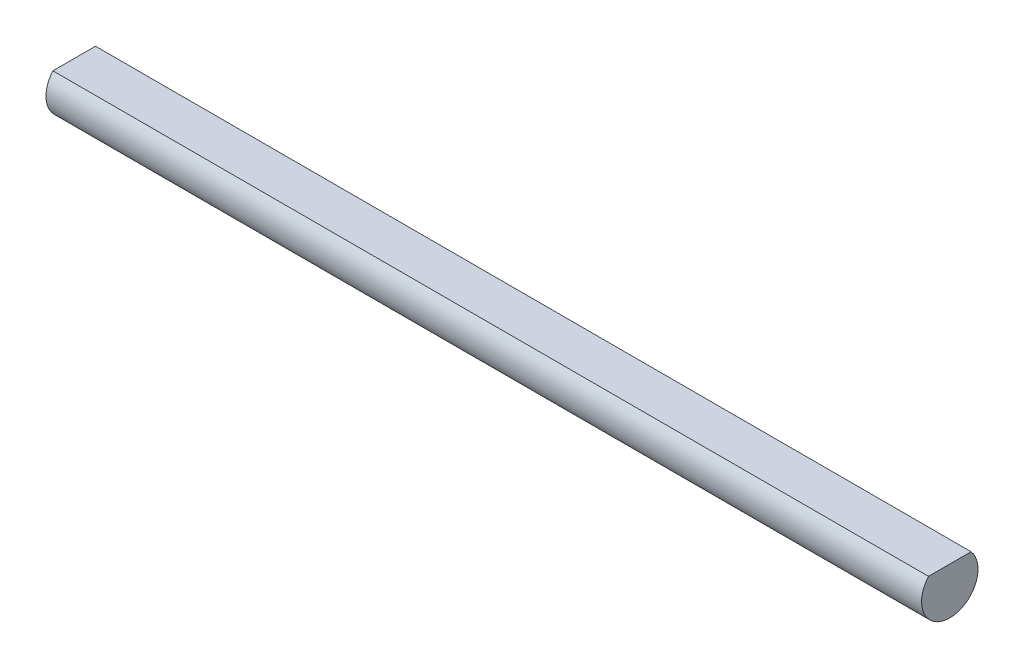
ISO-10303-21;
HEADER;
FILE_DESCRIPTION(('STEP AP214'),'2;1');
FILE_NAME('part.step','',(''),(''),'','','');
FILE_SCHEMA(('AUTOMOTIVE_DESIGN { 1 0 10303 214 1 1 1 1 }'));
ENDSEC;
DATA;
#1=APPLICATION_CONTEXT('core data for automotive mechanical design processes');
#2=APPLICATION_PROTOCOL_DEFINITION('international standard','automotive_design',2000,#1);
#3=PRODUCT_CONTEXT('',#1,'mechanical');
#4=PRODUCT('Part','Part','',(#3));
#5=PRODUCT_RELATED_PRODUCT_CATEGORY('part','',(#4));
#6=PRODUCT_DEFINITION_FORMATION('','',#4);
#7=PRODUCT_DEFINITION_CONTEXT('part definition',#1,'design');
#8=PRODUCT_DEFINITION('design','',#6,#7);
#9=PRODUCT_DEFINITION_SHAPE('','',#8);
#10=(LENGTH_UNIT() NAMED_UNIT(*) SI_UNIT(.MILLI.,.METRE.));
#11=(NAMED_UNIT(*) PLANE_ANGLE_UNIT() SI_UNIT($,.RADIAN.));
#12=(NAMED_UNIT(*) SI_UNIT($,.STERADIAN.) SOLID_ANGLE_UNIT());
#13=UNCERTAINTY_MEASURE_WITH_UNIT(LENGTH_MEASURE(1.E-05),#10,'distance_accuracy_value','');
#14=(GEOMETRIC_REPRESENTATION_CONTEXT(3) GLOBAL_UNCERTAINTY_ASSIGNED_CONTEXT((#13)) GLOBAL_UNIT_ASSIGNED_CONTEXT((#10,
#11,#12)) REPRESENTATION_CONTEXT('',''));
#15=CARTESIAN_POINT('',(0.,0.,0.));
#16=DIRECTION('',(0.,0.,1.));
#17=DIRECTION('',(1.,0.,0.));
#18=AXIS2_PLACEMENT_3D('',#15,#16,#17);
#19=CARTESIAN_POINT('',(-22.5,0.95,0.));
#20=DIRECTION('',(0.,-1.,0.));
#21=DIRECTION('',(0.,0.,-1.));
#22=AXIS2_PLACEMENT_3D('',#19,#20,#21);
#23=PLANE('',#22);
#24=DIRECTION('',(1.,0.,0.));
#25=VECTOR('',#24,1.);
#26=CARTESIAN_POINT('',(-22.5,0.95,1.09544511501033));
#27=LINE('',#26,#25);
#28=CARTESIAN_POINT('',(-22.5,0.95,1.09544511501033));
#29=VERTEX_POINT('',#28);
#30=CARTESIAN_POINT('',(22.5,0.95,1.09544511501033));
#31=VERTEX_POINT('',#30);
#32=EDGE_CURVE('E44',#29,#31,#27,.T.);
#33=ORIENTED_EDGE('',*,*,#32,.T.);
#34=DIRECTION('',(0.,0.,-1.));
#35=VECTOR('',#34,1.);
#36=CARTESIAN_POINT('',(22.5,0.95,0.));
#37=LINE('',#36,#35);
#38=CARTESIAN_POINT('',(22.5,0.95,-1.09544511501033));
#39=VERTEX_POINT('',#38);
#40=EDGE_CURVE('E69',#31,#39,#37,.T.);
#41=ORIENTED_EDGE('',*,*,#40,.T.);
#42=DIRECTION('',(1.,0.,0.));
#43=VECTOR('',#42,1.);
#44=CARTESIAN_POINT('',(-22.5,0.95,-1.09544511501033));
#45=LINE('',#44,#43);
#46=CARTESIAN_POINT('',(-22.5,0.95,-1.09544511501033));
#47=VERTEX_POINT('',#46);
#48=EDGE_CURVE('E11',#47,#39,#45,.T.);
#49=ORIENTED_EDGE('',*,*,#48,.F.);
#50=DIRECTION('',(0.,0.,-1.));
#51=VECTOR('',#50,1.);
#52=CARTESIAN_POINT('',(-22.5,0.95,0.));
#53=LINE('',#52,#51);
#54=EDGE_CURVE('E55',#29,#47,#53,.T.);
#55=ORIENTED_EDGE('',*,*,#54,.F.);
#56=EDGE_LOOP('',(#33,#41,#49,#55));
#57=FACE_BOUND('',#56,.T.);
#58=ADVANCED_FACE('F41',(#57),#23,.F.);
#59=CARTESIAN_POINT('',(-22.5,0.,0.));
#60=DIRECTION('',(1.,0.,0.));
#61=DIRECTION('',(0.,0.,-1.));
#62=AXIS2_PLACEMENT_3D('',#59,#60,#61);
#63=CYLINDRICAL_SURFACE('',#62,1.45);
#64=ORIENTED_EDGE('',*,*,#48,.T.);
#65=CARTESIAN_POINT('',(22.5,0.,0.));
#66=DIRECTION('',(1.,0.,0.));
#67=DIRECTION('',(0.,0.,-1.));
#68=AXIS2_PLACEMENT_3D('',#65,#66,#67);
#69=CIRCLE('',#68,1.45);
#70=EDGE_CURVE('E73',#31,#39,#69,.T.);
#71=ORIENTED_EDGE('',*,*,#70,.F.);
#72=ORIENTED_EDGE('',*,*,#32,.F.);
#73=CARTESIAN_POINT('',(-22.5,0.,0.));
#74=DIRECTION('',(1.,0.,0.));
#75=DIRECTION('',(0.,0.,-1.));
#76=AXIS2_PLACEMENT_3D('',#73,#74,#75);
#77=CIRCLE('',#76,1.45);
#78=EDGE_CURVE('E71',#29,#47,#77,.T.);
#79=ORIENTED_EDGE('',*,*,#78,.T.);
#80=EDGE_LOOP('',(#64,#71,#72,#79));
#81=FACE_BOUND('',#80,.T.);
#82=ADVANCED_FACE('F74',(#81),#63,.T.);
#83=CARTESIAN_POINT('',(-22.5,0.,0.));
#84=DIRECTION('',(1.,0.,0.));
#85=DIRECTION('',(0.,0.,-1.));
#86=AXIS2_PLACEMENT_3D('',#83,#84,#85);
#87=PLANE('',#86);
#88=ORIENTED_EDGE('',*,*,#54,.T.);
#89=ORIENTED_EDGE('',*,*,#78,.F.);
#90=EDGE_LOOP('',(#88,#89));
#91=FACE_BOUND('',#90,.T.);
#92=ADVANCED_FACE('F85',(#91),#87,.F.);
#93=CARTESIAN_POINT('',(22.5,0.,0.));
#94=DIRECTION('',(1.,0.,0.));
#95=DIRECTION('',(0.,0.,-1.));
#96=AXIS2_PLACEMENT_3D('',#93,#94,#95);
#97=PLANE('',#96);
#98=ORIENTED_EDGE('',*,*,#40,.F.);
#99=ORIENTED_EDGE('',*,*,#70,.T.);
#100=EDGE_LOOP('',(#98,#99));
#101=FACE_BOUND('',#100,.T.);
#102=ADVANCED_FACE('F78',(#101),#97,.T.);
#103=CLOSED_SHELL('',(#58,#82,#92,#102));
#104=MANIFOLD_SOLID_BREP('B2',#103);
#105=ADVANCED_BREP_SHAPE_REPRESENTATION('',(#18,#104),#14);
#106=SHAPE_DEFINITION_REPRESENTATION(#9,#105);
ENDSEC;
END-ISO-10303-21;
